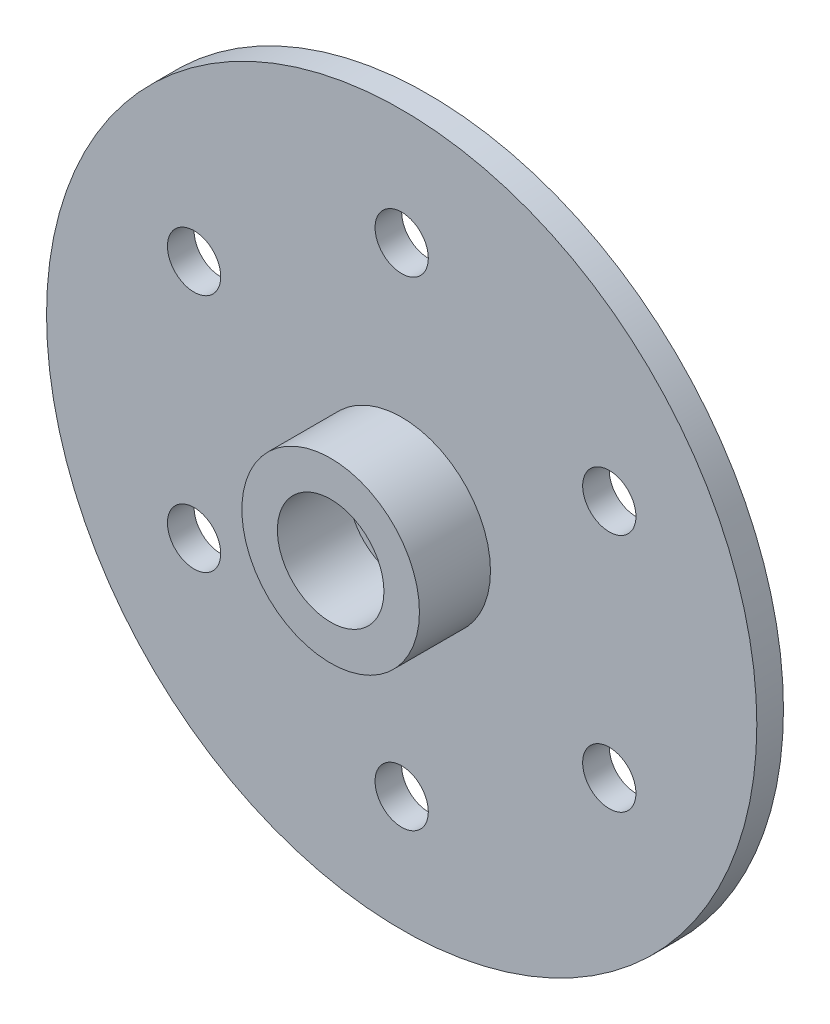
ISO-10303-21;
HEADER;
FILE_DESCRIPTION(('STEP AP214'),'2;1');
FILE_NAME('part.step','',(''),(''),'','','');
FILE_SCHEMA(('AUTOMOTIVE_DESIGN { 1 0 10303 214 1 1 1 1 }'));
ENDSEC;
DATA;
#1=APPLICATION_CONTEXT('core data for automotive mechanical design processes');
#2=APPLICATION_PROTOCOL_DEFINITION('international standard','automotive_design',2000,#1);
#3=PRODUCT_CONTEXT('',#1,'mechanical');
#4=PRODUCT('Part','Part','',(#3));
#5=PRODUCT_RELATED_PRODUCT_CATEGORY('part','',(#4));
#6=PRODUCT_DEFINITION_FORMATION('','',#4);
#7=PRODUCT_DEFINITION_CONTEXT('part definition',#1,'design');
#8=PRODUCT_DEFINITION('design','',#6,#7);
#9=PRODUCT_DEFINITION_SHAPE('','',#8);
#10=(LENGTH_UNIT() NAMED_UNIT(*) SI_UNIT(.MILLI.,.METRE.));
#11=(NAMED_UNIT(*) PLANE_ANGLE_UNIT() SI_UNIT($,.RADIAN.));
#12=(NAMED_UNIT(*) SI_UNIT($,.STERADIAN.) SOLID_ANGLE_UNIT());
#13=UNCERTAINTY_MEASURE_WITH_UNIT(LENGTH_MEASURE(1.E-05),#10,'distance_accuracy_value','');
#14=(GEOMETRIC_REPRESENTATION_CONTEXT(3) GLOBAL_UNCERTAINTY_ASSIGNED_CONTEXT((#13)) GLOBAL_UNIT_ASSIGNED_CONTEXT((#10,
#11,#12)) REPRESENTATION_CONTEXT('',''));
#15=CARTESIAN_POINT('',(0.,0.,0.));
#16=DIRECTION('',(0.,0.,1.));
#17=DIRECTION('',(1.,0.,0.));
#18=AXIS2_PLACEMENT_3D('',#15,#16,#17);
#19=CARTESIAN_POINT('',(-34.2487267745872,70.7944129826501,1.5));
#20=DIRECTION('',(0.,0.,1.));
#21=DIRECTION('',(1.,0.,0.));
#22=AXIS2_PLACEMENT_3D('',#19,#20,#21);
#23=PLANE('',#22);
#24=CARTESIAN_POINT('',(-34.2487267745872,70.7944129826501,1.5));
#25=DIRECTION('',(0.,0.,1.));
#26=DIRECTION('',(1.,0.,0.));
#27=AXIS2_PLACEMENT_3D('',#24,#25,#26);
#28=CIRCLE('',#27,0.999999999999998);
#29=CARTESIAN_POINT('',(-33.2487267745872,70.7944129826501,1.5));
#30=VERTEX_POINT('',#29);
#31=EDGE_CURVE('E83',#30,#30,#28,.T.);
#32=ORIENTED_EDGE('',*,*,#31,.F.);
#33=EDGE_LOOP('',(#32));
#34=FACE_BOUND('',#33,.T.);
#35=CARTESIAN_POINT('',(-34.2487267745872,70.7944129826501,1.5));
#36=DIRECTION('',(0.,0.,1.));
#37=DIRECTION('',(1.,0.,0.));
#38=AXIS2_PLACEMENT_3D('',#35,#36,#37);
#39=CIRCLE('',#38,3.);
#40=CARTESIAN_POINT('',(-31.2487267745872,70.7944129826501,1.5));
#41=VERTEX_POINT('',#40);
#42=EDGE_CURVE('E10',#41,#41,#39,.F.);
#43=ORIENTED_EDGE('',*,*,#42,.F.);
#44=EDGE_LOOP('',(#43));
#45=FACE_BOUND('',#44,.T.);
#46=ADVANCED_FACE('F32',(#34,#45),#23,.T.);
#47=CARTESIAN_POINT('',(-34.2487267745872,70.7944129826501,1.5));
#48=DIRECTION('',(0.,0.,1.));
#49=DIRECTION('',(1.,0.,0.));
#50=AXIS2_PLACEMENT_3D('',#47,#48,#49);
#51=CIRCLE('',#50,5.);
#52=CARTESIAN_POINT('',(-29.2487267745872,70.7944129826501,1.5));
#53=VERTEX_POINT('',#52);
#54=EDGE_CURVE('E92',#53,#53,#51,.T.);
#55=ORIENTED_EDGE('',*,*,#54,.F.);
#56=EDGE_LOOP('',(#55));
#57=FACE_BOUND('',#56,.T.);
#58=CARTESIAN_POINT('',(-45.9400697256772,64.0444129826502,1.5));
#59=DIRECTION('',(0.,0.,1.));
#60=DIRECTION('',(1.,0.,0.));
#61=AXIS2_PLACEMENT_3D('',#58,#59,#60);
#62=CIRCLE('',#61,1.5);
#63=CARTESIAN_POINT('',(-44.4400697256772,64.0444129826502,1.5));
#64=VERTEX_POINT('',#63);
#65=EDGE_CURVE('E77',#64,#64,#62,.T.);
#66=ORIENTED_EDGE('',*,*,#65,.F.);
#67=EDGE_LOOP('',(#66));
#68=FACE_BOUND('',#67,.T.);
#69=CARTESIAN_POINT('',(-22.5573838234973,64.04441298265,1.5));
#70=DIRECTION('',(0.,0.,1.));
#71=DIRECTION('',(1.,0.,0.));
#72=AXIS2_PLACEMENT_3D('',#69,#70,#71);
#73=CIRCLE('',#72,1.5);
#74=CARTESIAN_POINT('',(-21.0573838234973,64.04441298265,1.5));
#75=VERTEX_POINT('',#74);
#76=EDGE_CURVE('E65',#75,#75,#73,.T.);
#77=ORIENTED_EDGE('',*,*,#76,.F.);
#78=EDGE_LOOP('',(#77));
#79=FACE_BOUND('',#78,.T.);
#80=CARTESIAN_POINT('',(-34.2487267745872,84.2944129826501,1.5));
#81=DIRECTION('',(0.,0.,1.));
#82=DIRECTION('',(1.,0.,0.));
#83=AXIS2_PLACEMENT_3D('',#80,#81,#82);
#84=CIRCLE('',#83,1.5);
#85=CARTESIAN_POINT('',(-32.7487267745872,84.2944129826501,1.5));
#86=VERTEX_POINT('',#85);
#87=EDGE_CURVE('E53',#86,#86,#84,.T.);
#88=ORIENTED_EDGE('',*,*,#87,.F.);
#89=EDGE_LOOP('',(#88));
#90=FACE_BOUND('',#89,.T.);
#91=CARTESIAN_POINT('',(-34.2487267745872,70.7944129826501,1.5));
#92=DIRECTION('',(0.,0.,1.));
#93=DIRECTION('',(1.,0.,0.));
#94=AXIS2_PLACEMENT_3D('',#91,#92,#93);
#95=CIRCLE('',#94,20.);
#96=CARTESIAN_POINT('',(-14.2487267745872,70.7944129826501,1.5));
#97=VERTEX_POINT('',#96);
#98=EDGE_CURVE('E39',#97,#97,#95,.T.);
#99=ORIENTED_EDGE('',*,*,#98,.T.);
#100=EDGE_LOOP('',(#99));
#101=FACE_BOUND('',#100,.T.);
#102=CARTESIAN_POINT('',(-45.940069725677,77.5444129826502,1.5));
#103=DIRECTION('',(0.,0.,1.));
#104=DIRECTION('',(1.,0.,0.));
#105=AXIS2_PLACEMENT_3D('',#102,#103,#104);
#106=CIRCLE('',#105,1.5);
#107=CARTESIAN_POINT('',(-44.440069725677,77.5444129826502,1.5));
#108=VERTEX_POINT('',#107);
#109=EDGE_CURVE('E48',#108,#108,#106,.T.);
#110=ORIENTED_EDGE('',*,*,#109,.F.);
#111=EDGE_LOOP('',(#110));
#112=FACE_BOUND('',#111,.T.);
#113=CARTESIAN_POINT('',(-22.5573838234973,77.5444129826501,1.5));
#114=DIRECTION('',(0.,0.,1.));
#115=DIRECTION('',(1.,0.,0.));
#116=AXIS2_PLACEMENT_3D('',#113,#114,#115);
#117=CIRCLE('',#116,1.5);
#118=CARTESIAN_POINT('',(-21.0573838234973,77.5444129826501,1.5));
#119=VERTEX_POINT('',#118);
#120=EDGE_CURVE('E59',#119,#119,#117,.T.);
#121=ORIENTED_EDGE('',*,*,#120,.F.);
#122=EDGE_LOOP('',(#121));
#123=FACE_BOUND('',#122,.T.);
#124=CARTESIAN_POINT('',(-34.2487267745872,57.2944129826501,1.5));
#125=DIRECTION('',(0.,0.,1.));
#126=DIRECTION('',(1.,0.,0.));
#127=AXIS2_PLACEMENT_3D('',#124,#125,#126);
#128=CIRCLE('',#127,1.5);
#129=CARTESIAN_POINT('',(-32.7487267745872,57.2944129826501,1.5));
#130=VERTEX_POINT('',#129);
#131=EDGE_CURVE('E71',#130,#130,#128,.T.);
#132=ORIENTED_EDGE('',*,*,#131,.F.);
#133=EDGE_LOOP('',(#132));
#134=FACE_BOUND('',#133,.T.);
#135=ADVANCED_FACE('F120',(#57,#68,#79,#90,#101,#112,#123,#134),#23,.T.);
#136=CARTESIAN_POINT('',(-34.2487267745872,70.7944129826501,0.));
#137=DIRECTION('',(0.,0.,1.));
#138=DIRECTION('',(1.,0.,0.));
#139=AXIS2_PLACEMENT_3D('',#136,#137,#138);
#140=PLANE('',#139);
#141=CARTESIAN_POINT('',(-34.2487267745872,70.7944129826501,0.));
#142=DIRECTION('',(0.,0.,1.));
#143=DIRECTION('',(1.,0.,0.));
#144=AXIS2_PLACEMENT_3D('',#141,#142,#143);
#145=CIRCLE('',#144,20.);
#146=CARTESIAN_POINT('',(-14.2487267745872,70.7944129826501,0.));
#147=VERTEX_POINT('',#146);
#148=EDGE_CURVE('E43',#147,#147,#145,.T.);
#149=ORIENTED_EDGE('',*,*,#148,.F.);
#150=EDGE_LOOP('',(#149));
#151=FACE_BOUND('',#150,.T.);
#152=CARTESIAN_POINT('',(-45.940069725677,77.5444129826502,0.));
#153=DIRECTION('',(0.,0.,1.));
#154=DIRECTION('',(1.,0.,0.));
#155=AXIS2_PLACEMENT_3D('',#152,#153,#154);
#156=CIRCLE('',#155,1.5);
#157=CARTESIAN_POINT('',(-44.440069725677,77.5444129826502,0.));
#158=VERTEX_POINT('',#157);
#159=EDGE_CURVE('E50',#158,#158,#156,.T.);
#160=ORIENTED_EDGE('',*,*,#159,.T.);
#161=EDGE_LOOP('',(#160));
#162=FACE_BOUND('',#161,.T.);
#163=CARTESIAN_POINT('',(-34.2487267745872,84.2944129826501,0.));
#164=DIRECTION('',(0.,0.,1.));
#165=DIRECTION('',(1.,0.,0.));
#166=AXIS2_PLACEMENT_3D('',#163,#164,#165);
#167=CIRCLE('',#166,1.5);
#168=CARTESIAN_POINT('',(-32.7487267745872,84.2944129826501,0.));
#169=VERTEX_POINT('',#168);
#170=EDGE_CURVE('E56',#169,#169,#167,.T.);
#171=ORIENTED_EDGE('',*,*,#170,.T.);
#172=EDGE_LOOP('',(#171));
#173=FACE_BOUND('',#172,.T.);
#174=CARTESIAN_POINT('',(-22.5573838234973,77.5444129826501,0.));
#175=DIRECTION('',(0.,0.,1.));
#176=DIRECTION('',(1.,0.,0.));
#177=AXIS2_PLACEMENT_3D('',#174,#175,#176);
#178=CIRCLE('',#177,1.5);
#179=CARTESIAN_POINT('',(-21.0573838234973,77.5444129826501,0.));
#180=VERTEX_POINT('',#179);
#181=EDGE_CURVE('E62',#180,#180,#178,.T.);
#182=ORIENTED_EDGE('',*,*,#181,.T.);
#183=EDGE_LOOP('',(#182));
#184=FACE_BOUND('',#183,.T.);
#185=CARTESIAN_POINT('',(-22.5573838234973,64.04441298265,0.));
#186=DIRECTION('',(0.,0.,1.));
#187=DIRECTION('',(1.,0.,0.));
#188=AXIS2_PLACEMENT_3D('',#185,#186,#187);
#189=CIRCLE('',#188,1.5);
#190=CARTESIAN_POINT('',(-21.0573838234973,64.04441298265,0.));
#191=VERTEX_POINT('',#190);
#192=EDGE_CURVE('E68',#191,#191,#189,.T.);
#193=ORIENTED_EDGE('',*,*,#192,.T.);
#194=EDGE_LOOP('',(#193));
#195=FACE_BOUND('',#194,.T.);
#196=CARTESIAN_POINT('',(-34.2487267745872,57.2944129826501,0.));
#197=DIRECTION('',(0.,0.,1.));
#198=DIRECTION('',(1.,0.,0.));
#199=AXIS2_PLACEMENT_3D('',#196,#197,#198);
#200=CIRCLE('',#199,1.5);
#201=CARTESIAN_POINT('',(-32.7487267745872,57.2944129826501,0.));
#202=VERTEX_POINT('',#201);
#203=EDGE_CURVE('E74',#202,#202,#200,.T.);
#204=ORIENTED_EDGE('',*,*,#203,.T.);
#205=EDGE_LOOP('',(#204));
#206=FACE_BOUND('',#205,.T.);
#207=CARTESIAN_POINT('',(-45.9400697256772,64.0444129826502,0.));
#208=DIRECTION('',(0.,0.,1.));
#209=DIRECTION('',(1.,0.,0.));
#210=AXIS2_PLACEMENT_3D('',#207,#208,#209);
#211=CIRCLE('',#210,1.5);
#212=CARTESIAN_POINT('',(-44.4400697256772,64.0444129826502,0.));
#213=VERTEX_POINT('',#212);
#214=EDGE_CURVE('E80',#213,#213,#211,.T.);
#215=ORIENTED_EDGE('',*,*,#214,.T.);
#216=EDGE_LOOP('',(#215));
#217=FACE_BOUND('',#216,.T.);
#218=CARTESIAN_POINT('',(-34.2487267745872,70.7944129826501,0.));
#219=DIRECTION('',(0.,0.,1.));
#220=DIRECTION('',(1.,0.,0.));
#221=AXIS2_PLACEMENT_3D('',#218,#219,#220);
#222=CIRCLE('',#221,0.999999999999998);
#223=CARTESIAN_POINT('',(-33.2487267745872,70.7944129826501,0.));
#224=VERTEX_POINT('',#223);
#225=EDGE_CURVE('E86',#224,#224,#222,.T.);
#226=ORIENTED_EDGE('',*,*,#225,.T.);
#227=EDGE_LOOP('',(#226));
#228=FACE_BOUND('',#227,.T.);
#229=ADVANCED_FACE('F126',(#151,#162,#173,#184,#195,#206,#217,#228),#140,.F.);
#230=CARTESIAN_POINT('',(-34.2487267745872,70.7944129826501,1.5));
#231=DIRECTION('',(0.,0.,-1.));
#232=DIRECTION('',(-1.,0.,0.));
#233=AXIS2_PLACEMENT_3D('',#230,#231,#232);
#234=CYLINDRICAL_SURFACE('',#233,20.);
#235=ORIENTED_EDGE('',*,*,#98,.F.);
#236=EDGE_LOOP('',(#235));
#237=FACE_BOUND('',#236,.T.);
#238=ORIENTED_EDGE('',*,*,#148,.T.);
#239=EDGE_LOOP('',(#238));
#240=FACE_BOUND('',#239,.T.);
#241=ADVANCED_FACE('F34',(#237,#240),#234,.T.);
#242=CARTESIAN_POINT('',(-45.940069725677,77.5444129826502,1.5));
#243=DIRECTION('',(0.,0.,-1.));
#244=DIRECTION('',(-1.,0.,0.));
#245=AXIS2_PLACEMENT_3D('',#242,#243,#244);
#246=CYLINDRICAL_SURFACE('',#245,1.5);
#247=ORIENTED_EDGE('',*,*,#109,.T.);
#248=EDGE_LOOP('',(#247));
#249=FACE_BOUND('',#248,.T.);
#250=ORIENTED_EDGE('',*,*,#159,.F.);
#251=EDGE_LOOP('',(#250));
#252=FACE_BOUND('',#251,.T.);
#253=ADVANCED_FACE('F131',(#249,#252),#246,.F.);
#254=CARTESIAN_POINT('',(-34.2487267745872,84.2944129826501,1.5));
#255=DIRECTION('',(0.,0.,-1.));
#256=DIRECTION('',(-1.,0.,0.));
#257=AXIS2_PLACEMENT_3D('',#254,#255,#256);
#258=CYLINDRICAL_SURFACE('',#257,1.5);
#259=ORIENTED_EDGE('',*,*,#87,.T.);
#260=EDGE_LOOP('',(#259));
#261=FACE_BOUND('',#260,.T.);
#262=ORIENTED_EDGE('',*,*,#170,.F.);
#263=EDGE_LOOP('',(#262));
#264=FACE_BOUND('',#263,.T.);
#265=ADVANCED_FACE('F172',(#261,#264),#258,.F.);
#266=CARTESIAN_POINT('',(-22.5573838234973,77.5444129826501,1.5));
#267=DIRECTION('',(0.,0.,-1.));
#268=DIRECTION('',(-1.,0.,0.));
#269=AXIS2_PLACEMENT_3D('',#266,#267,#268);
#270=CYLINDRICAL_SURFACE('',#269,1.5);
#271=ORIENTED_EDGE('',*,*,#120,.T.);
#272=EDGE_LOOP('',(#271));
#273=FACE_BOUND('',#272,.T.);
#274=ORIENTED_EDGE('',*,*,#181,.F.);
#275=EDGE_LOOP('',(#274));
#276=FACE_BOUND('',#275,.T.);
#277=ADVANCED_FACE('F169',(#273,#276),#270,.F.);
#278=CARTESIAN_POINT('',(-22.5573838234973,64.04441298265,1.5));
#279=DIRECTION('',(0.,0.,-1.));
#280=DIRECTION('',(-1.,0.,0.));
#281=AXIS2_PLACEMENT_3D('',#278,#279,#280);
#282=CYLINDRICAL_SURFACE('',#281,1.5);
#283=ORIENTED_EDGE('',*,*,#76,.T.);
#284=EDGE_LOOP('',(#283));
#285=FACE_BOUND('',#284,.T.);
#286=ORIENTED_EDGE('',*,*,#192,.F.);
#287=EDGE_LOOP('',(#286));
#288=FACE_BOUND('',#287,.T.);
#289=ADVANCED_FACE('F163',(#285,#288),#282,.F.);
#290=CARTESIAN_POINT('',(-34.2487267745872,57.2944129826501,1.5));
#291=DIRECTION('',(0.,0.,-1.));
#292=DIRECTION('',(-1.,0.,0.));
#293=AXIS2_PLACEMENT_3D('',#290,#291,#292);
#294=CYLINDRICAL_SURFACE('',#293,1.5);
#295=ORIENTED_EDGE('',*,*,#131,.T.);
#296=EDGE_LOOP('',(#295));
#297=FACE_BOUND('',#296,.T.);
#298=ORIENTED_EDGE('',*,*,#203,.F.);
#299=EDGE_LOOP('',(#298));
#300=FACE_BOUND('',#299,.T.);
#301=ADVANCED_FACE('F157',(#297,#300),#294,.F.);
#302=CARTESIAN_POINT('',(-45.9400697256772,64.0444129826502,1.5));
#303=DIRECTION('',(0.,0.,-1.));
#304=DIRECTION('',(-1.,0.,0.));
#305=AXIS2_PLACEMENT_3D('',#302,#303,#304);
#306=CYLINDRICAL_SURFACE('',#305,1.5);
#307=ORIENTED_EDGE('',*,*,#65,.T.);
#308=EDGE_LOOP('',(#307));
#309=FACE_BOUND('',#308,.T.);
#310=ORIENTED_EDGE('',*,*,#214,.F.);
#311=EDGE_LOOP('',(#310));
#312=FACE_BOUND('',#311,.T.);
#313=ADVANCED_FACE('F115',(#309,#312),#306,.F.);
#314=CARTESIAN_POINT('',(-34.2487267745872,70.7944129826501,1.5));
#315=DIRECTION('',(0.,0.,-1.));
#316=DIRECTION('',(-1.,0.,0.));
#317=AXIS2_PLACEMENT_3D('',#314,#315,#316);
#318=CYLINDRICAL_SURFACE('',#317,0.999999999999998);
#319=ORIENTED_EDGE('',*,*,#31,.T.);
#320=EDGE_LOOP('',(#319));
#321=FACE_BOUND('',#320,.T.);
#322=ORIENTED_EDGE('',*,*,#225,.F.);
#323=EDGE_LOOP('',(#322));
#324=FACE_BOUND('',#323,.T.);
#325=ADVANCED_FACE('F106',(#321,#324),#318,.F.);
#326=CARTESIAN_POINT('',(-34.2487267745872,70.7944129826501,5.5));
#327=DIRECTION('',(0.,0.,1.));
#328=DIRECTION('',(1.,0.,0.));
#329=AXIS2_PLACEMENT_3D('',#326,#327,#328);
#330=PLANE('',#329);
#331=CARTESIAN_POINT('',(-34.2487267745872,70.7944129826501,5.5));
#332=DIRECTION('',(0.,0.,1.));
#333=DIRECTION('',(1.,0.,0.));
#334=AXIS2_PLACEMENT_3D('',#331,#332,#333);
#335=CIRCLE('',#334,5.);
#336=CARTESIAN_POINT('',(-29.2487267745872,70.7944129826501,5.5));
#337=VERTEX_POINT('',#336);
#338=EDGE_CURVE('E89',#337,#337,#335,.T.);
#339=ORIENTED_EDGE('',*,*,#338,.T.);
#340=EDGE_LOOP('',(#339));
#341=FACE_BOUND('',#340,.T.);
#342=CARTESIAN_POINT('',(-34.2487267745872,70.7944129826501,5.5));
#343=DIRECTION('',(0.,0.,1.));
#344=DIRECTION('',(1.,0.,0.));
#345=AXIS2_PLACEMENT_3D('',#342,#343,#344);
#346=CIRCLE('',#345,3.);
#347=CARTESIAN_POINT('',(-31.2487267745872,70.7944129826501,5.5));
#348=VERTEX_POINT('',#347);
#349=EDGE_CURVE('E95',#348,#348,#346,.T.);
#350=ORIENTED_EDGE('',*,*,#349,.F.);
#351=EDGE_LOOP('',(#350));
#352=FACE_BOUND('',#351,.T.);
#353=ADVANCED_FACE('F103',(#341,#352),#330,.T.);
#354=CARTESIAN_POINT('',(-34.2487267745872,70.7944129826501,5.5));
#355=DIRECTION('',(0.,0.,-1.));
#356=DIRECTION('',(-1.,0.,0.));
#357=AXIS2_PLACEMENT_3D('',#354,#355,#356);
#358=CYLINDRICAL_SURFACE('',#357,5.);
#359=ORIENTED_EDGE('',*,*,#338,.F.);
#360=EDGE_LOOP('',(#359));
#361=FACE_BOUND('',#360,.T.);
#362=ORIENTED_EDGE('',*,*,#54,.T.);
#363=EDGE_LOOP('',(#362));
#364=FACE_BOUND('',#363,.T.);
#365=ADVANCED_FACE('F105',(#361,#364),#358,.T.);
#366=CARTESIAN_POINT('',(-34.2487267745872,70.7944129826501,5.5));
#367=DIRECTION('',(0.,0.,-1.));
#368=DIRECTION('',(-1.,0.,0.));
#369=AXIS2_PLACEMENT_3D('',#366,#367,#368);
#370=CYLINDRICAL_SURFACE('',#369,3.);
#371=ORIENTED_EDGE('',*,*,#349,.T.);
#372=EDGE_LOOP('',(#371));
#373=FACE_BOUND('',#372,.T.);
#374=ORIENTED_EDGE('',*,*,#42,.T.);
#375=EDGE_LOOP('',(#374));
#376=FACE_BOUND('',#375,.T.);
#377=ADVANCED_FACE('F101',(#373,#376),#370,.F.);
#378=CLOSED_SHELL('',(#46,#135,#229,#241,#253,#265,#277,#289,#301,#313,#325,#353,#365,#377));
#379=MANIFOLD_SOLID_BREP('B2',#378);
#380=ADVANCED_BREP_SHAPE_REPRESENTATION('',(#18,#379),#14);
#381=SHAPE_DEFINITION_REPRESENTATION(#9,#380);
ENDSEC;
END-ISO-10303-21;
